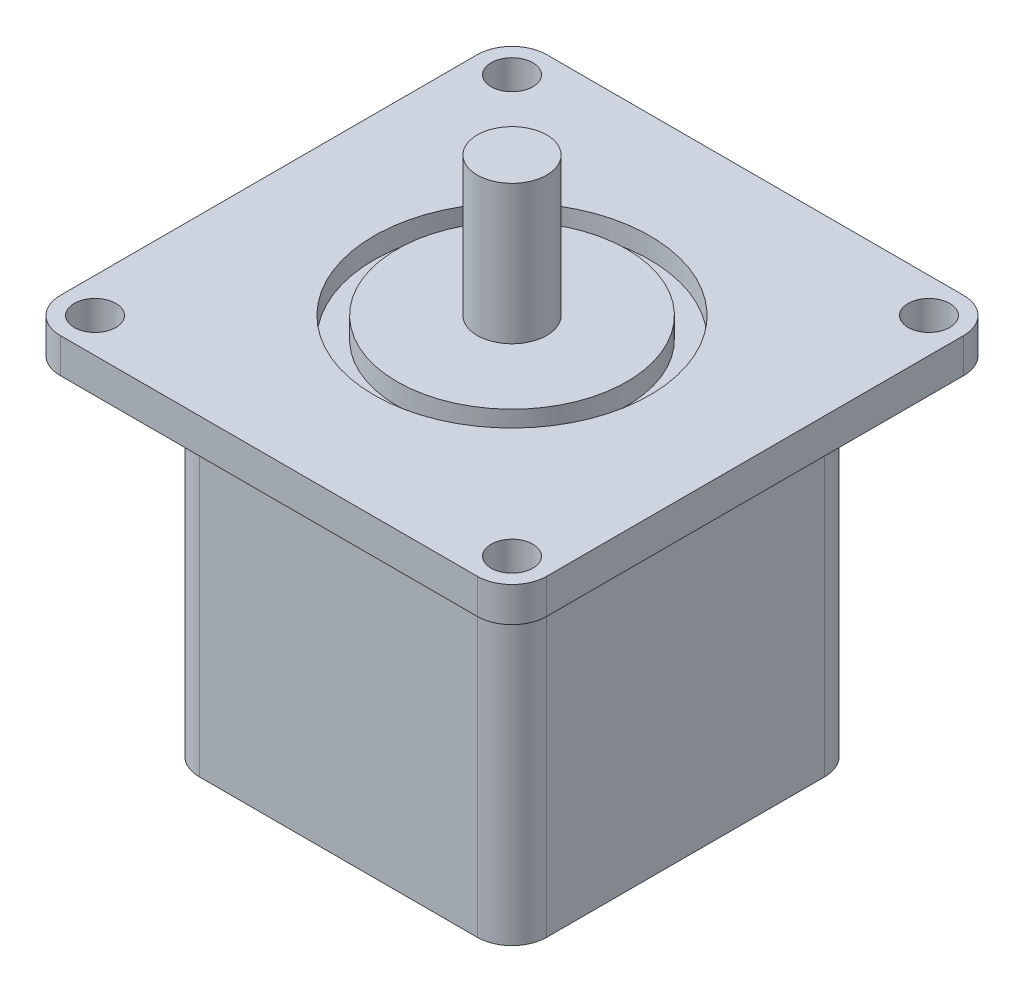
ISO-10303-21;
HEADER;
FILE_DESCRIPTION(('STEP AP214'),'2;1');
FILE_NAME('part.step','',(''),(''),'','','');
FILE_SCHEMA(('AUTOMOTIVE_DESIGN { 1 0 10303 214 1 1 1 1 }'));
ENDSEC;
DATA;
#1=APPLICATION_CONTEXT('core data for automotive mechanical design processes');
#2=APPLICATION_PROTOCOL_DEFINITION('international standard','automotive_design',2000,#1);
#3=PRODUCT_CONTEXT('',#1,'mechanical');
#4=PRODUCT('Part','Part','',(#3));
#5=PRODUCT_RELATED_PRODUCT_CATEGORY('part','',(#4));
#6=PRODUCT_DEFINITION_FORMATION('','',#4);
#7=PRODUCT_DEFINITION_CONTEXT('part definition',#1,'design');
#8=PRODUCT_DEFINITION('design','',#6,#7);
#9=PRODUCT_DEFINITION_SHAPE('','',#8);
#10=(LENGTH_UNIT() NAMED_UNIT(*) SI_UNIT(.MILLI.,.METRE.));
#11=(NAMED_UNIT(*) PLANE_ANGLE_UNIT() SI_UNIT($,.RADIAN.));
#12=(NAMED_UNIT(*) SI_UNIT($,.STERADIAN.) SOLID_ANGLE_UNIT());
#13=UNCERTAINTY_MEASURE_WITH_UNIT(LENGTH_MEASURE(1.E-05),#10,'distance_accuracy_value','');
#14=(GEOMETRIC_REPRESENTATION_CONTEXT(3) GLOBAL_UNCERTAINTY_ASSIGNED_CONTEXT((#13)) GLOBAL_UNIT_ASSIGNED_CONTEXT((#10,
#11,#12)) REPRESENTATION_CONTEXT('',''));
#15=CARTESIAN_POINT('',(0.,0.,0.));
#16=DIRECTION('',(0.,0.,1.));
#17=DIRECTION('',(1.,0.,0.));
#18=AXIS2_PLACEMENT_3D('',#15,#16,#17);
#19=CARTESIAN_POINT('',(25.,50.,-25.));
#20=DIRECTION('',(-1.,0.,0.));
#21=DIRECTION('',(0.,0.,1.));
#22=AXIS2_PLACEMENT_3D('',#19,#20,#21);
#23=PLANE('',#22);
#24=DIRECTION('',(0.,0.,-1.));
#25=VECTOR('',#24,1.);
#26=CARTESIAN_POINT('',(25.,50.,-25.));
#27=LINE('',#26,#25);
#28=CARTESIAN_POINT('',(25.,50.,20.));
#29=VERTEX_POINT('',#28);
#30=CARTESIAN_POINT('',(25.,50.,-20.));
#31=VERTEX_POINT('',#30);
#32=EDGE_CURVE('E194',#29,#31,#27,.T.);
#33=ORIENTED_EDGE('',*,*,#32,.F.);
#34=DIRECTION('',(0.,-1.,0.));
#35=VECTOR('',#34,1.);
#36=CARTESIAN_POINT('',(25.,50.,20.));
#37=LINE('',#36,#35);
#38=CARTESIAN_POINT('',(25.,0.,20.));
#39=VERTEX_POINT('',#38);
#40=EDGE_CURVE('E225',#29,#39,#37,.T.);
#41=ORIENTED_EDGE('',*,*,#40,.T.);
#42=DIRECTION('',(0.,0.,-1.));
#43=VECTOR('',#42,1.);
#44=CARTESIAN_POINT('',(25.,0.,-25.));
#45=LINE('',#44,#43);
#46=CARTESIAN_POINT('',(25.,0.,-20.));
#47=VERTEX_POINT('',#46);
#48=EDGE_CURVE('E196',#39,#47,#45,.T.);
#49=ORIENTED_EDGE('',*,*,#48,.T.);
#50=DIRECTION('',(0.,-1.,0.));
#51=VECTOR('',#50,1.);
#52=CARTESIAN_POINT('',(25.,50.,-20.));
#53=LINE('',#52,#51);
#54=EDGE_CURVE('E222',#47,#31,#53,.F.);
#55=ORIENTED_EDGE('',*,*,#54,.T.);
#56=EDGE_LOOP('',(#33,#41,#49,#55));
#57=FACE_BOUND('',#56,.T.);
#58=ADVANCED_FACE('F43',(#57),#23,.F.);
#59=CARTESIAN_POINT('',(-25.,50.,-25.));
#60=DIRECTION('',(0.,0.,1.));
#61=DIRECTION('',(1.,0.,0.));
#62=AXIS2_PLACEMENT_3D('',#59,#60,#61);
#63=PLANE('',#62);
#64=DIRECTION('',(-1.,0.,0.));
#65=VECTOR('',#64,1.);
#66=CARTESIAN_POINT('',(-25.,0.,-25.));
#67=LINE('',#66,#65);
#68=CARTESIAN_POINT('',(20.,0.,-25.));
#69=VERTEX_POINT('',#68);
#70=CARTESIAN_POINT('',(-20.,0.,-25.));
#71=VERTEX_POINT('',#70);
#72=EDGE_CURVE('E189',#69,#71,#67,.T.);
#73=ORIENTED_EDGE('',*,*,#72,.T.);
#74=DIRECTION('',(0.,-1.,0.));
#75=VECTOR('',#74,1.);
#76=CARTESIAN_POINT('',(-20.,50.,-25.));
#77=LINE('',#76,#75);
#78=CARTESIAN_POINT('',(-20.,50.,-25.));
#79=VERTEX_POINT('',#78);
#80=EDGE_CURVE('E164',#71,#79,#77,.F.);
#81=ORIENTED_EDGE('',*,*,#80,.T.);
#82=DIRECTION('',(-1.,0.,0.));
#83=VECTOR('',#82,1.);
#84=CARTESIAN_POINT('',(-25.,50.,-25.));
#85=LINE('',#84,#83);
#86=CARTESIAN_POINT('',(20.,50.,-25.));
#87=VERTEX_POINT('',#86);
#88=EDGE_CURVE('E317',#87,#79,#85,.T.);
#89=ORIENTED_EDGE('',*,*,#88,.F.);
#90=DIRECTION('',(0.,-1.,0.));
#91=VECTOR('',#90,1.);
#92=CARTESIAN_POINT('',(20.,50.,-25.));
#93=LINE('',#92,#91);
#94=EDGE_CURVE('E170',#87,#69,#93,.T.);
#95=ORIENTED_EDGE('',*,*,#94,.T.);
#96=EDGE_LOOP('',(#73,#81,#89,#95));
#97=FACE_BOUND('',#96,.T.);
#98=ADVANCED_FACE('F372',(#97),#63,.F.);
#99=CARTESIAN_POINT('',(-25.,50.,-25.));
#100=DIRECTION('',(1.,0.,0.));
#101=DIRECTION('',(0.,0.,-1.));
#102=AXIS2_PLACEMENT_3D('',#99,#100,#101);
#103=PLANE('',#102);
#104=DIRECTION('',(0.,0.,1.));
#105=VECTOR('',#104,1.);
#106=CARTESIAN_POINT('',(-25.,50.,-25.));
#107=LINE('',#106,#105);
#108=CARTESIAN_POINT('',(-25.,50.,-20.));
#109=VERTEX_POINT('',#108);
#110=CARTESIAN_POINT('',(-25.,50.,20.));
#111=VERTEX_POINT('',#110);
#112=EDGE_CURVE('E180',#109,#111,#107,.T.);
#113=ORIENTED_EDGE('',*,*,#112,.F.);
#114=DIRECTION('',(0.,-1.,0.));
#115=VECTOR('',#114,1.);
#116=CARTESIAN_POINT('',(-25.,50.,-20.));
#117=LINE('',#116,#115);
#118=CARTESIAN_POINT('',(-25.,0.,-20.));
#119=VERTEX_POINT('',#118);
#120=EDGE_CURVE('E163',#109,#119,#117,.T.);
#121=ORIENTED_EDGE('',*,*,#120,.T.);
#122=DIRECTION('',(0.,0.,1.));
#123=VECTOR('',#122,1.);
#124=CARTESIAN_POINT('',(-25.,0.,-25.));
#125=LINE('',#124,#123);
#126=CARTESIAN_POINT('',(-25.,0.,20.));
#127=VERTEX_POINT('',#126);
#128=EDGE_CURVE('E177',#119,#127,#125,.T.);
#129=ORIENTED_EDGE('',*,*,#128,.T.);
#130=DIRECTION('',(0.,-1.,0.));
#131=VECTOR('',#130,1.);
#132=CARTESIAN_POINT('',(-25.,50.,20.));
#133=LINE('',#132,#131);
#134=EDGE_CURVE('E183',#127,#111,#133,.F.);
#135=ORIENTED_EDGE('',*,*,#134,.T.);
#136=EDGE_LOOP('',(#113,#121,#129,#135));
#137=FACE_BOUND('',#136,.T.);
#138=ADVANCED_FACE('F176',(#137),#103,.F.);
#139=CARTESIAN_POINT('',(-25.,50.,25.));
#140=DIRECTION('',(0.,0.,-1.));
#141=DIRECTION('',(-1.,0.,0.));
#142=AXIS2_PLACEMENT_3D('',#139,#140,#141);
#143=PLANE('',#142);
#144=DIRECTION('',(1.,0.,0.));
#145=VECTOR('',#144,1.);
#146=CARTESIAN_POINT('',(-25.,50.,25.));
#147=LINE('',#146,#145);
#148=CARTESIAN_POINT('',(-20.,50.,25.));
#149=VERTEX_POINT('',#148);
#150=CARTESIAN_POINT('',(20.,50.,25.));
#151=VERTEX_POINT('',#150);
#152=EDGE_CURVE('E201',#149,#151,#147,.T.);
#153=ORIENTED_EDGE('',*,*,#152,.F.);
#154=DIRECTION('',(0.,-1.,0.));
#155=VECTOR('',#154,1.);
#156=CARTESIAN_POINT('',(-20.,50.,25.));
#157=LINE('',#156,#155);
#158=CARTESIAN_POINT('',(-20.,0.,25.));
#159=VERTEX_POINT('',#158);
#160=EDGE_CURVE('E218',#149,#159,#157,.T.);
#161=ORIENTED_EDGE('',*,*,#160,.T.);
#162=DIRECTION('',(1.,0.,0.));
#163=VECTOR('',#162,1.);
#164=CARTESIAN_POINT('',(-25.,0.,25.));
#165=LINE('',#164,#163);
#166=CARTESIAN_POINT('',(20.,0.,25.));
#167=VERTEX_POINT('',#166);
#168=EDGE_CURVE('E188',#159,#167,#165,.T.);
#169=ORIENTED_EDGE('',*,*,#168,.T.);
#170=DIRECTION('',(0.,-1.,0.));
#171=VECTOR('',#170,1.);
#172=CARTESIAN_POINT('',(20.,50.,25.));
#173=LINE('',#172,#171);
#174=EDGE_CURVE('E215',#167,#151,#173,.F.);
#175=ORIENTED_EDGE('',*,*,#174,.T.);
#176=EDGE_LOOP('',(#153,#161,#169,#175));
#177=FACE_BOUND('',#176,.T.);
#178=ADVANCED_FACE('F527',(#177),#143,.F.);
#179=CARTESIAN_POINT('',(0.,0.,0.));
#180=DIRECTION('',(0.,1.,0.));
#181=DIRECTION('',(0.,0.,1.));
#182=AXIS2_PLACEMENT_3D('',#179,#180,#181);
#183=PLANE('',#182);
#184=ORIENTED_EDGE('',*,*,#128,.F.);
#185=CARTESIAN_POINT('',(-20.,0.,-20.));
#186=DIRECTION('',(0.,1.,0.));
#187=DIRECTION('',(0.,0.,1.));
#188=AXIS2_PLACEMENT_3D('',#185,#186,#187);
#189=CIRCLE('',#188,5.);
#190=EDGE_CURVE('E159',#119,#71,#189,.F.);
#191=ORIENTED_EDGE('',*,*,#190,.T.);
#192=ORIENTED_EDGE('',*,*,#72,.F.);
#193=CARTESIAN_POINT('',(20.,0.,-20.));
#194=DIRECTION('',(0.,1.,0.));
#195=DIRECTION('',(0.,0.,1.));
#196=AXIS2_PLACEMENT_3D('',#193,#194,#195);
#197=CIRCLE('',#196,5.);
#198=EDGE_CURVE('E182',#69,#47,#197,.F.);
#199=ORIENTED_EDGE('',*,*,#198,.T.);
#200=ORIENTED_EDGE('',*,*,#48,.F.);
#201=CARTESIAN_POINT('',(20.,0.,20.));
#202=DIRECTION('',(0.,1.,0.));
#203=DIRECTION('',(0.,0.,1.));
#204=AXIS2_PLACEMENT_3D('',#201,#202,#203);
#205=CIRCLE('',#204,5.);
#206=EDGE_CURVE('E205',#39,#167,#205,.F.);
#207=ORIENTED_EDGE('',*,*,#206,.T.);
#208=ORIENTED_EDGE('',*,*,#168,.F.);
#209=CARTESIAN_POINT('',(-20.,0.,20.));
#210=DIRECTION('',(0.,1.,0.));
#211=DIRECTION('',(0.,0.,1.));
#212=AXIS2_PLACEMENT_3D('',#209,#210,#211);
#213=CIRCLE('',#212,5.);
#214=EDGE_CURVE('E171',#159,#127,#213,.F.);
#215=ORIENTED_EDGE('',*,*,#214,.T.);
#216=EDGE_LOOP('',(#184,#191,#192,#199,#200,#207,#208,#215));
#217=FACE_BOUND('',#216,.T.);
#218=ADVANCED_FACE('F185',(#217),#183,.F.);
#219=CARTESIAN_POINT('',(0.,50.,0.));
#220=DIRECTION('',(0.,1.,0.));
#221=DIRECTION('',(0.,0.,1.));
#222=AXIS2_PLACEMENT_3D('',#219,#220,#221);
#223=PLANE('',#222);
#224=DIRECTION('',(-1.,0.,0.));
#225=VECTOR('',#224,1.);
#226=CARTESIAN_POINT('',(-35.,50.,-35.));
#227=LINE('',#226,#225);
#228=CARTESIAN_POINT('',(30.,50.,-35.));
#229=VERTEX_POINT('',#228);
#230=CARTESIAN_POINT('',(-30.,50.,-35.));
#231=VERTEX_POINT('',#230);
#232=EDGE_CURVE('E310',#229,#231,#227,.T.);
#233=ORIENTED_EDGE('',*,*,#232,.F.);
#234=CARTESIAN_POINT('',(30.,50.,-30.));
#235=DIRECTION('',(0.,1.,0.));
#236=DIRECTION('',(0.,0.,1.));
#237=AXIS2_PLACEMENT_3D('',#234,#235,#236);
#238=CIRCLE('',#237,5.);
#239=CARTESIAN_POINT('',(35.,50.,-30.));
#240=VERTEX_POINT('',#239);
#241=EDGE_CURVE('E257',#229,#240,#238,.F.);
#242=ORIENTED_EDGE('',*,*,#241,.T.);
#243=DIRECTION('',(0.,0.,-1.));
#244=VECTOR('',#243,1.);
#245=CARTESIAN_POINT('',(35.,50.,-35.));
#246=LINE('',#245,#244);
#247=CARTESIAN_POINT('',(35.,50.,30.));
#248=VERTEX_POINT('',#247);
#249=EDGE_CURVE('E338',#248,#240,#246,.T.);
#250=ORIENTED_EDGE('',*,*,#249,.F.);
#251=CARTESIAN_POINT('',(30.,50.,30.));
#252=DIRECTION('',(0.,1.,0.));
#253=DIRECTION('',(0.,0.,1.));
#254=AXIS2_PLACEMENT_3D('',#251,#252,#253);
#255=CIRCLE('',#254,5.);
#256=CARTESIAN_POINT('',(30.,50.,35.));
#257=VERTEX_POINT('',#256);
#258=EDGE_CURVE('E251',#248,#257,#255,.F.);
#259=ORIENTED_EDGE('',*,*,#258,.T.);
#260=DIRECTION('',(1.,0.,0.));
#261=VECTOR('',#260,1.);
#262=CARTESIAN_POINT('',(-35.,50.,35.));
#263=LINE('',#262,#261);
#264=CARTESIAN_POINT('',(-30.,50.,35.));
#265=VERTEX_POINT('',#264);
#266=EDGE_CURVE('E291',#265,#257,#263,.T.);
#267=ORIENTED_EDGE('',*,*,#266,.F.);
#268=CARTESIAN_POINT('',(-30.,50.,30.));
#269=DIRECTION('',(0.,1.,0.));
#270=DIRECTION('',(0.,0.,1.));
#271=AXIS2_PLACEMENT_3D('',#268,#269,#270);
#272=CIRCLE('',#271,5.);
#273=CARTESIAN_POINT('',(-35.,50.,30.));
#274=VERTEX_POINT('',#273);
#275=EDGE_CURVE('E248',#265,#274,#272,.F.);
#276=ORIENTED_EDGE('',*,*,#275,.T.);
#277=DIRECTION('',(0.,0.,1.));
#278=VECTOR('',#277,1.);
#279=CARTESIAN_POINT('',(-35.,50.,-35.));
#280=LINE('',#279,#278);
#281=CARTESIAN_POINT('',(-35.,50.,-30.));
#282=VERTEX_POINT('',#281);
#283=EDGE_CURVE('E303',#282,#274,#280,.T.);
#284=ORIENTED_EDGE('',*,*,#283,.F.);
#285=CARTESIAN_POINT('',(-30.,50.,-30.));
#286=DIRECTION('',(0.,1.,0.));
#287=DIRECTION('',(0.,0.,1.));
#288=AXIS2_PLACEMENT_3D('',#285,#286,#287);
#289=CIRCLE('',#288,5.);
#290=EDGE_CURVE('E254',#282,#231,#289,.F.);
#291=ORIENTED_EDGE('',*,*,#290,.T.);
#292=EDGE_LOOP('',(#233,#242,#250,#259,#267,#276,#284,#291));
#293=FACE_BOUND('',#292,.T.);
#294=CARTESIAN_POINT('',(-30.,50.,-30.));
#295=DIRECTION('',(0.,1.,0.));
#296=DIRECTION('',(0.,0.,1.));
#297=AXIS2_PLACEMENT_3D('',#294,#295,#296);
#298=CIRCLE('',#297,3.);
#299=CARTESIAN_POINT('',(-30.,50.,-27.));
#300=VERTEX_POINT('',#299);
#301=EDGE_CURVE('E700',#300,#300,#298,.T.);
#302=ORIENTED_EDGE('',*,*,#301,.T.);
#303=EDGE_LOOP('',(#302));
#304=FACE_BOUND('',#303,.T.);
#305=CARTESIAN_POINT('',(30.,50.,-30.));
#306=DIRECTION('',(0.,1.,0.));
#307=DIRECTION('',(0.,0.,1.));
#308=AXIS2_PLACEMENT_3D('',#305,#306,#307);
#309=CIRCLE('',#308,3.);
#310=CARTESIAN_POINT('',(30.,50.,-27.));
#311=VERTEX_POINT('',#310);
#312=EDGE_CURVE('E708',#311,#311,#309,.T.);
#313=ORIENTED_EDGE('',*,*,#312,.T.);
#314=EDGE_LOOP('',(#313));
#315=FACE_BOUND('',#314,.T.);
#316=CARTESIAN_POINT('',(-30.,50.,30.));
#317=DIRECTION('',(0.,1.,0.));
#318=DIRECTION('',(0.,0.,1.));
#319=AXIS2_PLACEMENT_3D('',#316,#317,#318);
#320=CIRCLE('',#319,3.);
#321=CARTESIAN_POINT('',(-30.,50.,33.));
#322=VERTEX_POINT('',#321);
#323=EDGE_CURVE('E716',#322,#322,#320,.T.);
#324=ORIENTED_EDGE('',*,*,#323,.T.);
#325=EDGE_LOOP('',(#324));
#326=FACE_BOUND('',#325,.T.);
#327=CARTESIAN_POINT('',(30.,50.,30.));
#328=DIRECTION('',(0.,1.,0.));
#329=DIRECTION('',(0.,0.,1.));
#330=AXIS2_PLACEMENT_3D('',#327,#328,#329);
#331=CIRCLE('',#330,3.);
#332=CARTESIAN_POINT('',(30.,50.,33.));
#333=VERTEX_POINT('',#332);
#334=EDGE_CURVE('E724',#333,#333,#331,.T.);
#335=ORIENTED_EDGE('',*,*,#334,.T.);
#336=EDGE_LOOP('',(#335));
#337=FACE_BOUND('',#336,.T.);
#338=ORIENTED_EDGE('',*,*,#112,.T.);
#339=CARTESIAN_POINT('',(-20.,50.,20.));
#340=DIRECTION('',(0.,1.,0.));
#341=DIRECTION('',(0.,0.,1.));
#342=AXIS2_PLACEMENT_3D('',#339,#340,#341);
#343=CIRCLE('',#342,5.);
#344=EDGE_CURVE('E232',#111,#149,#343,.T.);
#345=ORIENTED_EDGE('',*,*,#344,.T.);
#346=ORIENTED_EDGE('',*,*,#152,.T.);
#347=CARTESIAN_POINT('',(20.,50.,20.));
#348=DIRECTION('',(0.,1.,0.));
#349=DIRECTION('',(0.,0.,1.));
#350=AXIS2_PLACEMENT_3D('',#347,#348,#349);
#351=CIRCLE('',#350,5.);
#352=EDGE_CURVE('E235',#151,#29,#351,.T.);
#353=ORIENTED_EDGE('',*,*,#352,.T.);
#354=ORIENTED_EDGE('',*,*,#32,.T.);
#355=CARTESIAN_POINT('',(20.,50.,-20.));
#356=DIRECTION('',(0.,1.,0.));
#357=DIRECTION('',(0.,0.,1.));
#358=AXIS2_PLACEMENT_3D('',#355,#356,#357);
#359=CIRCLE('',#358,5.);
#360=EDGE_CURVE('E238',#31,#87,#359,.T.);
#361=ORIENTED_EDGE('',*,*,#360,.T.);
#362=ORIENTED_EDGE('',*,*,#88,.T.);
#363=CARTESIAN_POINT('',(-20.,50.,-20.));
#364=DIRECTION('',(0.,1.,0.));
#365=DIRECTION('',(0.,0.,1.));
#366=AXIS2_PLACEMENT_3D('',#363,#364,#365);
#367=CIRCLE('',#366,5.);
#368=EDGE_CURVE('E229',#79,#109,#367,.T.);
#369=ORIENTED_EDGE('',*,*,#368,.T.);
#370=EDGE_LOOP('',(#338,#345,#346,#353,#354,#361,#362,#369));
#371=FACE_BOUND('',#370,.T.);
#372=ADVANCED_FACE('F296',(#293,#304,#315,#326,#337,#371),#223,.F.);
#373=CARTESIAN_POINT('',(0.,55.,0.));
#374=DIRECTION('',(0.,1.,0.));
#375=DIRECTION('',(0.,0.,1.));
#376=AXIS2_PLACEMENT_3D('',#373,#374,#375);
#377=PLANE('',#376);
#378=CARTESIAN_POINT('',(0.,55.,0.));
#379=DIRECTION('',(0.,1.,0.));
#380=DIRECTION('',(0.,0.,1.));
#381=AXIS2_PLACEMENT_3D('',#378,#379,#380);
#382=CIRCLE('',#381,19.8517317107256);
#383=CARTESIAN_POINT('',(0.,55.,19.8517317107256));
#384=VERTEX_POINT('',#383);
#385=EDGE_CURVE('E732',#384,#384,#382,.T.);
#386=ORIENTED_EDGE('',*,*,#385,.F.);
#387=EDGE_LOOP('',(#386));
#388=FACE_BOUND('',#387,.T.);
#389=CARTESIAN_POINT('',(-30.,55.,30.));
#390=DIRECTION('',(0.,1.,0.));
#391=DIRECTION('',(0.,0.,1.));
#392=AXIS2_PLACEMENT_3D('',#389,#390,#391);
#393=CIRCLE('',#392,3.);
#394=CARTESIAN_POINT('',(-30.,55.,33.));
#395=VERTEX_POINT('',#394);
#396=EDGE_CURVE('E712',#395,#395,#393,.T.);
#397=ORIENTED_EDGE('',*,*,#396,.F.);
#398=EDGE_LOOP('',(#397));
#399=FACE_BOUND('',#398,.T.);
#400=CARTESIAN_POINT('',(-30.,55.,-30.));
#401=DIRECTION('',(0.,1.,0.));
#402=DIRECTION('',(0.,0.,1.));
#403=AXIS2_PLACEMENT_3D('',#400,#401,#402);
#404=CIRCLE('',#403,3.);
#405=CARTESIAN_POINT('',(-30.,55.,-27.));
#406=VERTEX_POINT('',#405);
#407=EDGE_CURVE('E341',#406,#406,#404,.T.);
#408=ORIENTED_EDGE('',*,*,#407,.F.);
#409=EDGE_LOOP('',(#408));
#410=FACE_BOUND('',#409,.T.);
#411=DIRECTION('',(0.,0.,-1.));
#412=VECTOR('',#411,1.);
#413=CARTESIAN_POINT('',(35.,55.,-35.));
#414=LINE('',#413,#412);
#415=CARTESIAN_POINT('',(35.,55.,30.));
#416=VERTEX_POINT('',#415);
#417=CARTESIAN_POINT('',(35.,55.,-30.));
#418=VERTEX_POINT('',#417);
#419=EDGE_CURVE('E302',#416,#418,#414,.T.);
#420=ORIENTED_EDGE('',*,*,#419,.T.);
#421=CARTESIAN_POINT('',(30.,55.,-30.));
#422=DIRECTION('',(0.,1.,0.));
#423=DIRECTION('',(0.,0.,1.));
#424=AXIS2_PLACEMENT_3D('',#421,#422,#423);
#425=CIRCLE('',#424,5.);
#426=CARTESIAN_POINT('',(30.,55.,-35.));
#427=VERTEX_POINT('',#426);
#428=EDGE_CURVE('E275',#418,#427,#425,.T.);
#429=ORIENTED_EDGE('',*,*,#428,.T.);
#430=DIRECTION('',(-1.,0.,0.));
#431=VECTOR('',#430,1.);
#432=CARTESIAN_POINT('',(-35.,55.,-35.));
#433=LINE('',#432,#431);
#434=CARTESIAN_POINT('',(-30.,55.,-35.));
#435=VERTEX_POINT('',#434);
#436=EDGE_CURVE('E308',#427,#435,#433,.T.);
#437=ORIENTED_EDGE('',*,*,#436,.T.);
#438=CARTESIAN_POINT('',(-30.,55.,-30.));
#439=DIRECTION('',(0.,1.,0.));
#440=DIRECTION('',(0.,0.,1.));
#441=AXIS2_PLACEMENT_3D('',#438,#439,#440);
#442=CIRCLE('',#441,5.);
#443=CARTESIAN_POINT('',(-35.,55.,-30.));
#444=VERTEX_POINT('',#443);
#445=EDGE_CURVE('E272',#435,#444,#442,.T.);
#446=ORIENTED_EDGE('',*,*,#445,.T.);
#447=DIRECTION('',(0.,0.,1.));
#448=VECTOR('',#447,1.);
#449=CARTESIAN_POINT('',(-35.,55.,-35.));
#450=LINE('',#449,#448);
#451=CARTESIAN_POINT('',(-35.,55.,30.));
#452=VERTEX_POINT('',#451);
#453=EDGE_CURVE('E331',#444,#452,#450,.T.);
#454=ORIENTED_EDGE('',*,*,#453,.T.);
#455=CARTESIAN_POINT('',(-30.,55.,30.));
#456=DIRECTION('',(0.,1.,0.));
#457=DIRECTION('',(0.,0.,1.));
#458=AXIS2_PLACEMENT_3D('',#455,#456,#457);
#459=CIRCLE('',#458,5.);
#460=CARTESIAN_POINT('',(-30.,55.,35.));
#461=VERTEX_POINT('',#460);
#462=EDGE_CURVE('E66',#452,#461,#459,.T.);
#463=ORIENTED_EDGE('',*,*,#462,.T.);
#464=DIRECTION('',(1.,0.,0.));
#465=VECTOR('',#464,1.);
#466=CARTESIAN_POINT('',(-35.,55.,35.));
#467=LINE('',#466,#465);
#468=CARTESIAN_POINT('',(30.,55.,35.));
#469=VERTEX_POINT('',#468);
#470=EDGE_CURVE('E292',#461,#469,#467,.T.);
#471=ORIENTED_EDGE('',*,*,#470,.T.);
#472=CARTESIAN_POINT('',(30.,55.,30.));
#473=DIRECTION('',(0.,1.,0.));
#474=DIRECTION('',(0.,0.,1.));
#475=AXIS2_PLACEMENT_3D('',#472,#473,#474);
#476=CIRCLE('',#475,5.);
#477=EDGE_CURVE('E269',#469,#416,#476,.T.);
#478=ORIENTED_EDGE('',*,*,#477,.T.);
#479=EDGE_LOOP('',(#420,#429,#437,#446,#454,#463,#471,#478));
#480=FACE_BOUND('',#479,.T.);
#481=CARTESIAN_POINT('',(30.,55.,-30.));
#482=DIRECTION('',(0.,1.,0.));
#483=DIRECTION('',(0.,0.,1.));
#484=AXIS2_PLACEMENT_3D('',#481,#482,#483);
#485=CIRCLE('',#484,3.);
#486=CARTESIAN_POINT('',(30.,55.,-27.));
#487=VERTEX_POINT('',#486);
#488=EDGE_CURVE('E704',#487,#487,#485,.T.);
#489=ORIENTED_EDGE('',*,*,#488,.F.);
#490=EDGE_LOOP('',(#489));
#491=FACE_BOUND('',#490,.T.);
#492=CARTESIAN_POINT('',(30.,55.,30.));
#493=DIRECTION('',(0.,1.,0.));
#494=DIRECTION('',(0.,0.,1.));
#495=AXIS2_PLACEMENT_3D('',#492,#493,#494);
#496=CIRCLE('',#495,3.);
#497=CARTESIAN_POINT('',(30.,55.,33.));
#498=VERTEX_POINT('',#497);
#499=EDGE_CURVE('E720',#498,#498,#496,.T.);
#500=ORIENTED_EDGE('',*,*,#499,.F.);
#501=EDGE_LOOP('',(#500));
#502=FACE_BOUND('',#501,.T.);
#503=ADVANCED_FACE('F355',(#388,#399,#410,#480,#491,#502),#377,.T.);
#504=CARTESIAN_POINT('',(35.,55.,-35.));
#505=DIRECTION('',(-1.,0.,0.));
#506=DIRECTION('',(0.,0.,1.));
#507=AXIS2_PLACEMENT_3D('',#504,#505,#506);
#508=PLANE('',#507);
#509=ORIENTED_EDGE('',*,*,#249,.T.);
#510=DIRECTION('',(0.,-1.,0.));
#511=VECTOR('',#510,1.);
#512=CARTESIAN_POINT('',(35.,55.,-30.));
#513=LINE('',#512,#511);
#514=EDGE_CURVE('E264',#240,#418,#513,.F.);
#515=ORIENTED_EDGE('',*,*,#514,.T.);
#516=ORIENTED_EDGE('',*,*,#419,.F.);
#517=DIRECTION('',(0.,-1.,0.));
#518=VECTOR('',#517,1.);
#519=CARTESIAN_POINT('',(35.,55.,30.));
#520=LINE('',#519,#518);
#521=EDGE_CURVE('E260',#416,#248,#520,.T.);
#522=ORIENTED_EDGE('',*,*,#521,.T.);
#523=EDGE_LOOP('',(#509,#515,#516,#522));
#524=FACE_BOUND('',#523,.T.);
#525=ADVANCED_FACE('F426',(#524),#508,.F.);
#526=CARTESIAN_POINT('',(-35.,55.,-35.));
#527=DIRECTION('',(0.,0.,1.));
#528=DIRECTION('',(1.,0.,0.));
#529=AXIS2_PLACEMENT_3D('',#526,#527,#528);
#530=PLANE('',#529);
#531=ORIENTED_EDGE('',*,*,#436,.F.);
#532=DIRECTION('',(0.,-1.,0.));
#533=VECTOR('',#532,1.);
#534=CARTESIAN_POINT('',(30.,55.,-35.));
#535=LINE('',#534,#533);
#536=EDGE_CURVE('E244',#427,#229,#535,.T.);
#537=ORIENTED_EDGE('',*,*,#536,.T.);
#538=ORIENTED_EDGE('',*,*,#232,.T.);
#539=DIRECTION('',(0.,-1.,0.));
#540=VECTOR('',#539,1.);
#541=CARTESIAN_POINT('',(-30.,55.,-35.));
#542=LINE('',#541,#540);
#543=EDGE_CURVE('E241',#231,#435,#542,.F.);
#544=ORIENTED_EDGE('',*,*,#543,.T.);
#545=EDGE_LOOP('',(#531,#537,#538,#544));
#546=FACE_BOUND('',#545,.T.);
#547=ADVANCED_FACE('F347',(#546),#530,.F.);
#548=CARTESIAN_POINT('',(-35.,55.,-35.));
#549=DIRECTION('',(1.,0.,0.));
#550=DIRECTION('',(0.,0.,-1.));
#551=AXIS2_PLACEMENT_3D('',#548,#549,#550);
#552=PLANE('',#551);
#553=ORIENTED_EDGE('',*,*,#453,.F.);
#554=DIRECTION('',(0.,-1.,0.));
#555=VECTOR('',#554,1.);
#556=CARTESIAN_POINT('',(-35.,55.,-30.));
#557=LINE('',#556,#555);
#558=EDGE_CURVE('E281',#444,#282,#557,.T.);
#559=ORIENTED_EDGE('',*,*,#558,.T.);
#560=ORIENTED_EDGE('',*,*,#283,.T.);
#561=DIRECTION('',(0.,-1.,0.));
#562=VECTOR('',#561,1.);
#563=CARTESIAN_POINT('',(-35.,55.,30.));
#564=LINE('',#563,#562);
#565=EDGE_CURVE('E278',#274,#452,#564,.F.);
#566=ORIENTED_EDGE('',*,*,#565,.T.);
#567=EDGE_LOOP('',(#553,#559,#560,#566));
#568=FACE_BOUND('',#567,.T.);
#569=ADVANCED_FACE('F358',(#568),#552,.F.);
#570=CARTESIAN_POINT('',(-35.,55.,35.));
#571=DIRECTION('',(0.,0.,-1.));
#572=DIRECTION('',(-1.,0.,0.));
#573=AXIS2_PLACEMENT_3D('',#570,#571,#572);
#574=PLANE('',#573);
#575=ORIENTED_EDGE('',*,*,#266,.T.);
#576=DIRECTION('',(0.,-1.,0.));
#577=VECTOR('',#576,1.);
#578=CARTESIAN_POINT('',(30.,55.,35.));
#579=LINE('',#578,#577);
#580=EDGE_CURVE('E47',#257,#469,#579,.F.);
#581=ORIENTED_EDGE('',*,*,#580,.T.);
#582=ORIENTED_EDGE('',*,*,#470,.F.);
#583=DIRECTION('',(0.,-1.,0.));
#584=VECTOR('',#583,1.);
#585=CARTESIAN_POINT('',(-30.,55.,35.));
#586=LINE('',#585,#584);
#587=EDGE_CURVE('E284',#461,#265,#586,.T.);
#588=ORIENTED_EDGE('',*,*,#587,.T.);
#589=EDGE_LOOP('',(#575,#581,#582,#588));
#590=FACE_BOUND('',#589,.T.);
#591=ADVANCED_FACE('F290',(#590),#574,.F.);
#592=CARTESIAN_POINT('',(-30.,55.,-30.));
#593=DIRECTION('',(0.,-1.,0.));
#594=DIRECTION('',(0.,0.,-1.));
#595=AXIS2_PLACEMENT_3D('',#592,#593,#594);
#596=CYLINDRICAL_SURFACE('',#595,3.);
#597=ORIENTED_EDGE('',*,*,#407,.T.);
#598=EDGE_LOOP('',(#597));
#599=FACE_BOUND('',#598,.T.);
#600=ORIENTED_EDGE('',*,*,#301,.F.);
#601=EDGE_LOOP('',(#600));
#602=FACE_BOUND('',#601,.T.);
#603=ADVANCED_FACE('F511',(#599,#602),#596,.F.);
#604=CARTESIAN_POINT('',(30.,55.,-30.));
#605=DIRECTION('',(0.,-1.,0.));
#606=DIRECTION('',(0.,0.,-1.));
#607=AXIS2_PLACEMENT_3D('',#604,#605,#606);
#608=CYLINDRICAL_SURFACE('',#607,3.);
#609=ORIENTED_EDGE('',*,*,#488,.T.);
#610=EDGE_LOOP('',(#609));
#611=FACE_BOUND('',#610,.T.);
#612=ORIENTED_EDGE('',*,*,#312,.F.);
#613=EDGE_LOOP('',(#612));
#614=FACE_BOUND('',#613,.T.);
#615=ADVANCED_FACE('F507',(#611,#614),#608,.F.);
#616=CARTESIAN_POINT('',(-30.,55.,30.));
#617=DIRECTION('',(0.,-1.,0.));
#618=DIRECTION('',(0.,0.,-1.));
#619=AXIS2_PLACEMENT_3D('',#616,#617,#618);
#620=CYLINDRICAL_SURFACE('',#619,3.);
#621=ORIENTED_EDGE('',*,*,#396,.T.);
#622=EDGE_LOOP('',(#621));
#623=FACE_BOUND('',#622,.T.);
#624=ORIENTED_EDGE('',*,*,#323,.F.);
#625=EDGE_LOOP('',(#624));
#626=FACE_BOUND('',#625,.T.);
#627=ADVANCED_FACE('F503',(#623,#626),#620,.F.);
#628=CARTESIAN_POINT('',(30.,55.,30.));
#629=DIRECTION('',(0.,-1.,0.));
#630=DIRECTION('',(0.,0.,-1.));
#631=AXIS2_PLACEMENT_3D('',#628,#629,#630);
#632=CYLINDRICAL_SURFACE('',#631,3.);
#633=ORIENTED_EDGE('',*,*,#499,.T.);
#634=EDGE_LOOP('',(#633));
#635=FACE_BOUND('',#634,.T.);
#636=ORIENTED_EDGE('',*,*,#334,.F.);
#637=EDGE_LOOP('',(#636));
#638=FACE_BOUND('',#637,.T.);
#639=ADVANCED_FACE('F385',(#635,#638),#632,.F.);
#640=CARTESIAN_POINT('',(-20.,50.,-20.));
#641=DIRECTION('',(0.,-1.,0.));
#642=DIRECTION('',(0.,0.,-1.));
#643=AXIS2_PLACEMENT_3D('',#640,#641,#642);
#644=CYLINDRICAL_SURFACE('',#643,5.);
#645=ORIENTED_EDGE('',*,*,#368,.F.);
#646=ORIENTED_EDGE('',*,*,#80,.F.);
#647=ORIENTED_EDGE('',*,*,#190,.F.);
#648=ORIENTED_EDGE('',*,*,#120,.F.);
#649=EDGE_LOOP('',(#645,#646,#647,#648));
#650=FACE_BOUND('',#649,.T.);
#651=ADVANCED_FACE('F162',(#650),#644,.T.);
#652=CARTESIAN_POINT('',(-20.,50.,20.));
#653=DIRECTION('',(0.,-1.,0.));
#654=DIRECTION('',(0.,0.,-1.));
#655=AXIS2_PLACEMENT_3D('',#652,#653,#654);
#656=CYLINDRICAL_SURFACE('',#655,5.);
#657=ORIENTED_EDGE('',*,*,#344,.F.);
#658=ORIENTED_EDGE('',*,*,#134,.F.);
#659=ORIENTED_EDGE('',*,*,#214,.F.);
#660=ORIENTED_EDGE('',*,*,#160,.F.);
#661=EDGE_LOOP('',(#657,#658,#659,#660));
#662=FACE_BOUND('',#661,.T.);
#663=ADVANCED_FACE('F384',(#662),#656,.T.);
#664=CARTESIAN_POINT('',(20.,50.,20.));
#665=DIRECTION('',(0.,-1.,0.));
#666=DIRECTION('',(0.,0.,-1.));
#667=AXIS2_PLACEMENT_3D('',#664,#665,#666);
#668=CYLINDRICAL_SURFACE('',#667,5.);
#669=ORIENTED_EDGE('',*,*,#352,.F.);
#670=ORIENTED_EDGE('',*,*,#174,.F.);
#671=ORIENTED_EDGE('',*,*,#206,.F.);
#672=ORIENTED_EDGE('',*,*,#40,.F.);
#673=EDGE_LOOP('',(#669,#670,#671,#672));
#674=FACE_BOUND('',#673,.T.);
#675=ADVANCED_FACE('F388',(#674),#668,.T.);
#676=CARTESIAN_POINT('',(20.,50.,-20.));
#677=DIRECTION('',(0.,-1.,0.));
#678=DIRECTION('',(0.,0.,-1.));
#679=AXIS2_PLACEMENT_3D('',#676,#677,#678);
#680=CYLINDRICAL_SURFACE('',#679,5.);
#681=ORIENTED_EDGE('',*,*,#360,.F.);
#682=ORIENTED_EDGE('',*,*,#54,.F.);
#683=ORIENTED_EDGE('',*,*,#198,.F.);
#684=ORIENTED_EDGE('',*,*,#94,.F.);
#685=EDGE_LOOP('',(#681,#682,#683,#684));
#686=FACE_BOUND('',#685,.T.);
#687=ADVANCED_FACE('F392',(#686),#680,.T.);
#688=CARTESIAN_POINT('',(30.,55.,-30.));
#689=DIRECTION('',(0.,-1.,0.));
#690=DIRECTION('',(0.,0.,-1.));
#691=AXIS2_PLACEMENT_3D('',#688,#689,#690);
#692=CYLINDRICAL_SURFACE('',#691,5.);
#693=ORIENTED_EDGE('',*,*,#428,.F.);
#694=ORIENTED_EDGE('',*,*,#514,.F.);
#695=ORIENTED_EDGE('',*,*,#241,.F.);
#696=ORIENTED_EDGE('',*,*,#536,.F.);
#697=EDGE_LOOP('',(#693,#694,#695,#696));
#698=FACE_BOUND('',#697,.T.);
#699=ADVANCED_FACE('F396',(#698),#692,.T.);
#700=CARTESIAN_POINT('',(-30.,55.,-30.));
#701=DIRECTION('',(0.,-1.,0.));
#702=DIRECTION('',(0.,0.,-1.));
#703=AXIS2_PLACEMENT_3D('',#700,#701,#702);
#704=CYLINDRICAL_SURFACE('',#703,5.);
#705=ORIENTED_EDGE('',*,*,#445,.F.);
#706=ORIENTED_EDGE('',*,*,#543,.F.);
#707=ORIENTED_EDGE('',*,*,#290,.F.);
#708=ORIENTED_EDGE('',*,*,#558,.F.);
#709=EDGE_LOOP('',(#705,#706,#707,#708));
#710=FACE_BOUND('',#709,.T.);
#711=ADVANCED_FACE('F352',(#710),#704,.T.);
#712=CARTESIAN_POINT('',(30.,55.,30.));
#713=DIRECTION('',(0.,-1.,0.));
#714=DIRECTION('',(0.,0.,-1.));
#715=AXIS2_PLACEMENT_3D('',#712,#713,#714);
#716=CYLINDRICAL_SURFACE('',#715,5.);
#717=ORIENTED_EDGE('',*,*,#477,.F.);
#718=ORIENTED_EDGE('',*,*,#580,.F.);
#719=ORIENTED_EDGE('',*,*,#258,.F.);
#720=ORIENTED_EDGE('',*,*,#521,.F.);
#721=EDGE_LOOP('',(#717,#718,#719,#720));
#722=FACE_BOUND('',#721,.T.);
#723=ADVANCED_FACE('F362',(#722),#716,.T.);
#724=CARTESIAN_POINT('',(-30.,55.,30.));
#725=DIRECTION('',(0.,-1.,0.));
#726=DIRECTION('',(0.,0.,-1.));
#727=AXIS2_PLACEMENT_3D('',#724,#725,#726);
#728=CYLINDRICAL_SURFACE('',#727,5.);
#729=ORIENTED_EDGE('',*,*,#462,.F.);
#730=ORIENTED_EDGE('',*,*,#565,.F.);
#731=ORIENTED_EDGE('',*,*,#275,.F.);
#732=ORIENTED_EDGE('',*,*,#587,.F.);
#733=EDGE_LOOP('',(#729,#730,#731,#732));
#734=FACE_BOUND('',#733,.T.);
#735=ADVANCED_FACE('F45',(#734),#728,.T.);
#736=CARTESIAN_POINT('',(0.,52.,0.));
#737=DIRECTION('',(0.,1.,0.));
#738=DIRECTION('',(0.,0.,1.));
#739=AXIS2_PLACEMENT_3D('',#736,#737,#738);
#740=CYLINDRICAL_SURFACE('',#739,19.8517317107256);
#741=CARTESIAN_POINT('',(0.,52.,0.));
#742=DIRECTION('',(0.,1.,0.));
#743=DIRECTION('',(0.,0.,1.));
#744=AXIS2_PLACEMENT_3D('',#741,#742,#743);
#745=CIRCLE('',#744,19.8517317107256);
#746=CARTESIAN_POINT('',(0.,52.,19.8517317107256));
#747=VERTEX_POINT('',#746);
#748=EDGE_CURVE('E728',#747,#747,#745,.T.);
#749=ORIENTED_EDGE('',*,*,#748,.F.);
#750=EDGE_LOOP('',(#749));
#751=FACE_BOUND('',#750,.T.);
#752=ORIENTED_EDGE('',*,*,#385,.T.);
#753=EDGE_LOOP('',(#752));
#754=FACE_BOUND('',#753,.T.);
#755=ADVANCED_FACE('F361',(#751,#754),#740,.F.);
#756=CARTESIAN_POINT('',(0.,52.,0.));
#757=DIRECTION('',(0.,1.,0.));
#758=DIRECTION('',(0.,0.,1.));
#759=AXIS2_PLACEMENT_3D('',#756,#757,#758);
#760=PLANE('',#759);
#761=CARTESIAN_POINT('',(0.,52.,0.));
#762=DIRECTION('',(0.,1.,0.));
#763=DIRECTION('',(0.,0.,1.));
#764=AXIS2_PLACEMENT_3D('',#761,#762,#763);
#765=CIRCLE('',#764,16.5288823728851);
#766=CARTESIAN_POINT('',(0.,52.,16.5288823728851));
#767=VERTEX_POINT('',#766);
#768=EDGE_CURVE('E736',#767,#767,#765,.T.);
#769=ORIENTED_EDGE('',*,*,#768,.F.);
#770=EDGE_LOOP('',(#769));
#771=FACE_BOUND('',#770,.T.);
#772=ORIENTED_EDGE('',*,*,#748,.T.);
#773=EDGE_LOOP('',(#772));
#774=FACE_BOUND('',#773,.T.);
#775=ADVANCED_FACE('F367',(#771,#774),#760,.T.);
#776=CARTESIAN_POINT('',(0.,52.,0.));
#777=DIRECTION('',(0.,1.,0.));
#778=DIRECTION('',(0.,0.,1.));
#779=AXIS2_PLACEMENT_3D('',#776,#777,#778);
#780=CYLINDRICAL_SURFACE('',#779,16.5288823728851);
#781=ORIENTED_EDGE('',*,*,#768,.T.);
#782=EDGE_LOOP('',(#781));
#783=FACE_BOUND('',#782,.T.);
#784=CARTESIAN_POINT('',(0.,55.,0.));
#785=DIRECTION('',(0.,1.,0.));
#786=DIRECTION('',(0.,0.,1.));
#787=AXIS2_PLACEMENT_3D('',#784,#785,#786);
#788=CIRCLE('',#787,16.5288823728851);
#789=CARTESIAN_POINT('',(0.,55.,16.5288823728851));
#790=VERTEX_POINT('',#789);
#791=EDGE_CURVE('E740',#790,#790,#788,.T.);
#792=ORIENTED_EDGE('',*,*,#791,.F.);
#793=EDGE_LOOP('',(#792));
#794=FACE_BOUND('',#793,.T.);
#795=ADVANCED_FACE('F449',(#783,#794),#780,.T.);
#796=CARTESIAN_POINT('',(0.,55.,0.));
#797=DIRECTION('',(0.,1.,0.));
#798=DIRECTION('',(0.,0.,1.));
#799=AXIS2_PLACEMENT_3D('',#796,#797,#798);
#800=CIRCLE('',#799,5.);
#801=CARTESIAN_POINT('',(0.,55.,5.));
#802=VERTEX_POINT('',#801);
#803=EDGE_CURVE('E11',#802,#802,#800,.T.);
#804=ORIENTED_EDGE('',*,*,#803,.F.);
#805=EDGE_LOOP('',(#804));
#806=FACE_BOUND('',#805,.T.);
#807=ORIENTED_EDGE('',*,*,#791,.T.);
#808=EDGE_LOOP('',(#807));
#809=FACE_BOUND('',#808,.T.);
#810=ADVANCED_FACE('F429',(#806,#809),#377,.T.);
#811=CARTESIAN_POINT('',(0.,75.,0.));
#812=DIRECTION('',(0.,-1.,0.));
#813=DIRECTION('',(0.,0.,-1.));
#814=AXIS2_PLACEMENT_3D('',#811,#812,#813);
#815=CYLINDRICAL_SURFACE('',#814,5.);
#816=CARTESIAN_POINT('',(0.,75.,0.));
#817=DIRECTION('',(0.,1.,0.));
#818=DIRECTION('',(0.,0.,1.));
#819=AXIS2_PLACEMENT_3D('',#816,#817,#818);
#820=CIRCLE('',#819,5.);
#821=CARTESIAN_POINT('',(0.,75.,5.));
#822=VERTEX_POINT('',#821);
#823=EDGE_CURVE('E744',#822,#822,#820,.T.);
#824=ORIENTED_EDGE('',*,*,#823,.F.);
#825=EDGE_LOOP('',(#824));
#826=FACE_BOUND('',#825,.T.);
#827=ORIENTED_EDGE('',*,*,#803,.T.);
#828=EDGE_LOOP('',(#827));
#829=FACE_BOUND('',#828,.T.);
#830=ADVANCED_FACE('F471',(#826,#829),#815,.T.);
#831=CARTESIAN_POINT('',(0.,75.,0.));
#832=DIRECTION('',(0.,1.,0.));
#833=DIRECTION('',(0.,0.,1.));
#834=AXIS2_PLACEMENT_3D('',#831,#832,#833);
#835=PLANE('',#834);
#836=ORIENTED_EDGE('',*,*,#823,.T.);
#837=EDGE_LOOP('',(#836));
#838=FACE_BOUND('',#837,.T.);
#839=ADVANCED_FACE('F478',(#838),#835,.T.);
#840=CLOSED_SHELL('',(#58,#98,#138,#178,#218,#372,#503,#525,#547,#569,#591,#603,#615,#627,#639,
#651,#663,#675,#687,#699,#711,#723,#735,#755,#775,#795,#810,#830,#839));
#841=MANIFOLD_SOLID_BREP('B2',#840);
#842=ADVANCED_BREP_SHAPE_REPRESENTATION('',(#18,#841),#14);
#843=SHAPE_DEFINITION_REPRESENTATION(#9,#842);
ENDSEC;
END-ISO-10303-21;
